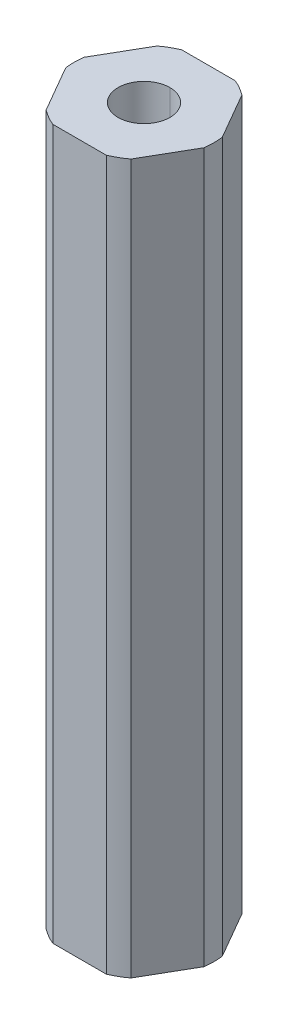
ISO-10303-21;
HEADER;
FILE_DESCRIPTION(('STEP AP214'),'2;1');
FILE_NAME('part.step','',(''),(''),'','','');
FILE_SCHEMA(('AUTOMOTIVE_DESIGN { 1 0 10303 214 1 1 1 1 }'));
ENDSEC;
DATA;
#1=APPLICATION_CONTEXT('core data for automotive mechanical design processes');
#2=APPLICATION_PROTOCOL_DEFINITION('international standard','automotive_design',2000,#1);
#3=PRODUCT_CONTEXT('',#1,'mechanical');
#4=PRODUCT('Part','Part','',(#3));
#5=PRODUCT_RELATED_PRODUCT_CATEGORY('part','',(#4));
#6=PRODUCT_DEFINITION_FORMATION('','',#4);
#7=PRODUCT_DEFINITION_CONTEXT('part definition',#1,'design');
#8=PRODUCT_DEFINITION('design','',#6,#7);
#9=PRODUCT_DEFINITION_SHAPE('','',#8);
#10=(LENGTH_UNIT() NAMED_UNIT(*) SI_UNIT(.MILLI.,.METRE.));
#11=(NAMED_UNIT(*) PLANE_ANGLE_UNIT() SI_UNIT($,.RADIAN.));
#12=(NAMED_UNIT(*) SI_UNIT($,.STERADIAN.) SOLID_ANGLE_UNIT());
#13=UNCERTAINTY_MEASURE_WITH_UNIT(LENGTH_MEASURE(1.E-05),#10,'distance_accuracy_value','');
#14=(GEOMETRIC_REPRESENTATION_CONTEXT(3) GLOBAL_UNCERTAINTY_ASSIGNED_CONTEXT((#13)) GLOBAL_UNIT_ASSIGNED_CONTEXT((#10,
#11,#12)) REPRESENTATION_CONTEXT('',''));
#15=CARTESIAN_POINT('',(0.,0.,0.));
#16=DIRECTION('',(0.,0.,1.));
#17=DIRECTION('',(1.,0.,0.));
#18=AXIS2_PLACEMENT_3D('',#15,#16,#17);
#19=CARTESIAN_POINT('',(5.49926131403118,-34.925,-3.175));
#20=DIRECTION('',(-0.866025403784439,0.,0.5));
#21=DIRECTION('',(0.,1.,0.));
#22=AXIS2_PLACEMENT_3D('',#19,#20,#21);
#23=PLANE('',#22);
#24=DIRECTION('',(0.5,0.,0.866025403784439));
#25=VECTOR('',#24,1.);
#26=CARTESIAN_POINT('',(5.49926131403118,34.925,-3.175));
#27=LINE('',#26,#25);
#28=CARTESIAN_POINT('',(4.18177080173137,34.925,-5.45696050579321));
#29=VERTEX_POINT('',#28);
#30=CARTESIAN_POINT('',(6.81675182633099,34.925,-0.893039494206796));
#31=VERTEX_POINT('',#30);
#32=EDGE_CURVE('E175',#29,#31,#27,.T.);
#33=ORIENTED_EDGE('',*,*,#32,.T.);
#34=DIRECTION('',(0.,1.,0.));
#35=VECTOR('',#34,1.);
#36=CARTESIAN_POINT('',(6.81675182633099,-34.925,-0.893039494206796));
#37=LINE('',#36,#35);
#38=CARTESIAN_POINT('',(6.81675182633099,-34.925,-0.893039494206796));
#39=VERTEX_POINT('',#38);
#40=EDGE_CURVE('E11',#39,#31,#37,.T.);
#41=ORIENTED_EDGE('',*,*,#40,.F.);
#42=DIRECTION('',(0.5,0.,0.866025403784439));
#43=VECTOR('',#42,1.);
#44=CARTESIAN_POINT('',(5.49926131403118,-34.925,-3.175));
#45=LINE('',#44,#43);
#46=CARTESIAN_POINT('',(4.18177080173137,-34.925,-5.45696050579321));
#47=VERTEX_POINT('',#46);
#48=EDGE_CURVE('E190',#47,#39,#45,.T.);
#49=ORIENTED_EDGE('',*,*,#48,.F.);
#50=DIRECTION('',(0.,1.,0.));
#51=VECTOR('',#50,1.);
#52=CARTESIAN_POINT('',(4.18177080173137,-34.925,-5.45696050579321));
#53=LINE('',#52,#51);
#54=EDGE_CURVE('E166',#47,#29,#53,.T.);
#55=ORIENTED_EDGE('',*,*,#54,.T.);
#56=EDGE_LOOP('',(#33,#41,#49,#55));
#57=FACE_BOUND('',#56,.T.);
#58=ADVANCED_FACE('F17',(#57),#23,.F.);
#59=CARTESIAN_POINT('',(0.,-34.925,0.));
#60=DIRECTION('',(0.,1.,0.));
#61=DIRECTION('',(0.,0.,1.));
#62=AXIS2_PLACEMENT_3D('',#59,#60,#61);
#63=CYLINDRICAL_SURFACE('',#62,6.875);
#64=CARTESIAN_POINT('',(0.,34.925,0.));
#65=DIRECTION('',(0.,-1.,0.));
#66=DIRECTION('',(0.,0.,-1.));
#67=AXIS2_PLACEMENT_3D('',#64,#65,#66);
#68=CIRCLE('',#67,6.875);
#69=CARTESIAN_POINT('',(6.81675182633099,34.925,0.893039494206792));
#70=VERTEX_POINT('',#69);
#71=EDGE_CURVE('E191',#31,#70,#68,.T.);
#72=ORIENTED_EDGE('',*,*,#71,.T.);
#73=DIRECTION('',(0.,1.,0.));
#74=VECTOR('',#73,1.);
#75=CARTESIAN_POINT('',(6.81675182633099,-34.925,0.893039494206792));
#76=LINE('',#75,#74);
#77=CARTESIAN_POINT('',(6.81675182633099,-34.925,0.893039494206792));
#78=VERTEX_POINT('',#77);
#79=EDGE_CURVE('E25',#78,#70,#76,.T.);
#80=ORIENTED_EDGE('',*,*,#79,.F.);
#81=CARTESIAN_POINT('',(0.,-34.925,0.));
#82=DIRECTION('',(0.,-1.,0.));
#83=DIRECTION('',(0.,0.,-1.));
#84=AXIS2_PLACEMENT_3D('',#81,#82,#83);
#85=CIRCLE('',#84,6.875);
#86=EDGE_CURVE('E256',#39,#78,#85,.T.);
#87=ORIENTED_EDGE('',*,*,#86,.F.);
#88=ORIENTED_EDGE('',*,*,#40,.T.);
#89=EDGE_LOOP('',(#72,#80,#87,#88));
#90=FACE_BOUND('',#89,.T.);
#91=ADVANCED_FACE('F335',(#90),#63,.T.);
#92=CARTESIAN_POINT('',(5.49926131403119,-34.925,3.175));
#93=DIRECTION('',(-0.866025403784439,0.,-0.5));
#94=DIRECTION('',(-0.5,0.,0.866025403784439));
#95=AXIS2_PLACEMENT_3D('',#92,#93,#94);
#96=PLANE('',#95);
#97=DIRECTION('',(-0.5,0.,0.866025403784439));
#98=VECTOR('',#97,1.);
#99=CARTESIAN_POINT('',(5.49926131403119,34.925,3.175));
#100=LINE('',#99,#98);
#101=CARTESIAN_POINT('',(4.18177080173138,34.925,5.45696050579321));
#102=VERTEX_POINT('',#101);
#103=EDGE_CURVE('E220',#70,#102,#100,.T.);
#104=ORIENTED_EDGE('',*,*,#103,.T.);
#105=DIRECTION('',(0.,1.,0.));
#106=VECTOR('',#105,1.);
#107=CARTESIAN_POINT('',(4.18177080173138,-34.925,5.45696050579321));
#108=LINE('',#107,#106);
#109=CARTESIAN_POINT('',(4.18177080173138,-34.925,5.45696050579321));
#110=VERTEX_POINT('',#109);
#111=EDGE_CURVE('E304',#110,#102,#108,.T.);
#112=ORIENTED_EDGE('',*,*,#111,.F.);
#113=DIRECTION('',(-0.5,0.,0.866025403784439));
#114=VECTOR('',#113,1.);
#115=CARTESIAN_POINT('',(5.49926131403119,-34.925,3.175));
#116=LINE('',#115,#114);
#117=EDGE_CURVE('E208',#78,#110,#116,.T.);
#118=ORIENTED_EDGE('',*,*,#117,.F.);
#119=ORIENTED_EDGE('',*,*,#79,.T.);
#120=EDGE_LOOP('',(#104,#112,#118,#119));
#121=FACE_BOUND('',#120,.T.);
#122=ADVANCED_FACE('F321',(#121),#96,.F.);
#123=CARTESIAN_POINT('',(0.,-34.925,0.));
#124=DIRECTION('',(0.,1.,0.));
#125=DIRECTION('',(0.,0.,1.));
#126=AXIS2_PLACEMENT_3D('',#123,#124,#125);
#127=CYLINDRICAL_SURFACE('',#126,6.875);
#128=CARTESIAN_POINT('',(0.,34.925,0.));
#129=DIRECTION('',(0.,-1.,0.));
#130=DIRECTION('',(0.,0.,-1.));
#131=AXIS2_PLACEMENT_3D('',#128,#129,#130);
#132=CIRCLE('',#131,6.875);
#133=CARTESIAN_POINT('',(2.63498102459961,34.925,6.35));
#134=VERTEX_POINT('',#133);
#135=EDGE_CURVE('E228',#102,#134,#132,.T.);
#136=ORIENTED_EDGE('',*,*,#135,.T.);
#137=DIRECTION('',(0.,1.,0.));
#138=VECTOR('',#137,1.);
#139=CARTESIAN_POINT('',(2.63498102459961,-34.925,6.35));
#140=LINE('',#139,#138);
#141=CARTESIAN_POINT('',(2.63498102459961,-34.925,6.35));
#142=VERTEX_POINT('',#141);
#143=EDGE_CURVE('E246',#142,#134,#140,.T.);
#144=ORIENTED_EDGE('',*,*,#143,.F.);
#145=CARTESIAN_POINT('',(0.,-34.925,0.));
#146=DIRECTION('',(0.,-1.,0.));
#147=DIRECTION('',(0.,0.,-1.));
#148=AXIS2_PLACEMENT_3D('',#145,#146,#147);
#149=CIRCLE('',#148,6.875);
#150=EDGE_CURVE('E203',#110,#142,#149,.T.);
#151=ORIENTED_EDGE('',*,*,#150,.F.);
#152=ORIENTED_EDGE('',*,*,#111,.T.);
#153=EDGE_LOOP('',(#136,#144,#151,#152));
#154=FACE_BOUND('',#153,.T.);
#155=ADVANCED_FACE('F315',(#154),#127,.T.);
#156=CARTESIAN_POINT('',(0.,-34.925,6.35));
#157=DIRECTION('',(0.,0.,-1.));
#158=DIRECTION('',(0.,-1.,0.));
#159=AXIS2_PLACEMENT_3D('',#156,#157,#158);
#160=PLANE('',#159);
#161=DIRECTION('',(-1.,0.,0.));
#162=VECTOR('',#161,1.);
#163=CARTESIAN_POINT('',(0.,34.925,6.35));
#164=LINE('',#163,#162);
#165=CARTESIAN_POINT('',(-2.63498102459961,34.925,6.35));
#166=VERTEX_POINT('',#165);
#167=EDGE_CURVE('E232',#134,#166,#164,.T.);
#168=ORIENTED_EDGE('',*,*,#167,.T.);
#169=DIRECTION('',(0.,1.,0.));
#170=VECTOR('',#169,1.);
#171=CARTESIAN_POINT('',(-2.63498102459961,-34.925,6.35));
#172=LINE('',#171,#170);
#173=CARTESIAN_POINT('',(-2.63498102459961,-34.925,6.35));
#174=VERTEX_POINT('',#173);
#175=EDGE_CURVE('E243',#174,#166,#172,.T.);
#176=ORIENTED_EDGE('',*,*,#175,.F.);
#177=DIRECTION('',(-1.,0.,0.));
#178=VECTOR('',#177,1.);
#179=CARTESIAN_POINT('',(0.,-34.925,6.35));
#180=LINE('',#179,#178);
#181=EDGE_CURVE('E207',#142,#174,#180,.T.);
#182=ORIENTED_EDGE('',*,*,#181,.F.);
#183=ORIENTED_EDGE('',*,*,#143,.T.);
#184=EDGE_LOOP('',(#168,#176,#182,#183));
#185=FACE_BOUND('',#184,.T.);
#186=ADVANCED_FACE('F329',(#185),#160,.F.);
#187=CARTESIAN_POINT('',(0.,-34.925,0.));
#188=DIRECTION('',(0.,1.,0.));
#189=DIRECTION('',(0.,0.,1.));
#190=AXIS2_PLACEMENT_3D('',#187,#188,#189);
#191=CYLINDRICAL_SURFACE('',#190,6.875);
#192=CARTESIAN_POINT('',(0.,34.925,0.));
#193=DIRECTION('',(0.,-1.,0.));
#194=DIRECTION('',(0.,0.,-1.));
#195=AXIS2_PLACEMENT_3D('',#192,#193,#194);
#196=CIRCLE('',#195,6.875);
#197=CARTESIAN_POINT('',(-4.18177080173138,34.925,5.45696050579322));
#198=VERTEX_POINT('',#197);
#199=EDGE_CURVE('E233',#166,#198,#196,.T.);
#200=ORIENTED_EDGE('',*,*,#199,.T.);
#201=DIRECTION('',(0.,1.,0.));
#202=VECTOR('',#201,1.);
#203=CARTESIAN_POINT('',(-4.18177080173138,-34.925,5.45696050579322));
#204=LINE('',#203,#202);
#205=CARTESIAN_POINT('',(-4.18177080173138,-34.925,5.45696050579322));
#206=VERTEX_POINT('',#205);
#207=EDGE_CURVE('E224',#206,#198,#204,.T.);
#208=ORIENTED_EDGE('',*,*,#207,.F.);
#209=CARTESIAN_POINT('',(0.,-34.925,0.));
#210=DIRECTION('',(0.,-1.,0.));
#211=DIRECTION('',(0.,0.,-1.));
#212=AXIS2_PLACEMENT_3D('',#209,#210,#211);
#213=CIRCLE('',#212,6.875);
#214=EDGE_CURVE('E266',#174,#206,#213,.T.);
#215=ORIENTED_EDGE('',*,*,#214,.F.);
#216=ORIENTED_EDGE('',*,*,#175,.T.);
#217=EDGE_LOOP('',(#200,#208,#215,#216));
#218=FACE_BOUND('',#217,.T.);
#219=ADVANCED_FACE('F356',(#218),#191,.T.);
#220=CARTESIAN_POINT('',(-5.49926131403118,-34.925,3.175));
#221=DIRECTION('',(0.866025403784439,0.,-0.5));
#222=DIRECTION('',(0.,-1.,0.));
#223=AXIS2_PLACEMENT_3D('',#220,#221,#222);
#224=PLANE('',#223);
#225=DIRECTION('',(-0.5,0.,-0.866025403784439));
#226=VECTOR('',#225,1.);
#227=CARTESIAN_POINT('',(-5.49926131403118,34.925,3.175));
#228=LINE('',#227,#226);
#229=CARTESIAN_POINT('',(-6.81675182633099,34.925,0.893039494206796));
#230=VERTEX_POINT('',#229);
#231=EDGE_CURVE('E201',#198,#230,#228,.T.);
#232=ORIENTED_EDGE('',*,*,#231,.T.);
#233=DIRECTION('',(0.,1.,0.));
#234=VECTOR('',#233,1.);
#235=CARTESIAN_POINT('',(-6.81675182633099,-34.925,0.893039494206796));
#236=LINE('',#235,#234);
#237=CARTESIAN_POINT('',(-6.81675182633099,-34.925,0.893039494206796));
#238=VERTEX_POINT('',#237);
#239=EDGE_CURVE('E221',#238,#230,#236,.T.);
#240=ORIENTED_EDGE('',*,*,#239,.F.);
#241=DIRECTION('',(-0.5,0.,-0.866025403784439));
#242=VECTOR('',#241,1.);
#243=CARTESIAN_POINT('',(-5.49926131403118,-34.925,3.175));
#244=LINE('',#243,#242);
#245=EDGE_CURVE('E270',#206,#238,#244,.T.);
#246=ORIENTED_EDGE('',*,*,#245,.F.);
#247=ORIENTED_EDGE('',*,*,#207,.T.);
#248=EDGE_LOOP('',(#232,#240,#246,#247));
#249=FACE_BOUND('',#248,.T.);
#250=ADVANCED_FACE('F354',(#249),#224,.F.);
#251=CARTESIAN_POINT('',(0.,-34.925,0.));
#252=DIRECTION('',(0.,1.,0.));
#253=DIRECTION('',(0.,0.,1.));
#254=AXIS2_PLACEMENT_3D('',#251,#252,#253);
#255=CYLINDRICAL_SURFACE('',#254,6.875);
#256=CARTESIAN_POINT('',(0.,34.925,0.));
#257=DIRECTION('',(0.,-1.,0.));
#258=DIRECTION('',(0.,0.,-1.));
#259=AXIS2_PLACEMENT_3D('',#256,#257,#258);
#260=CIRCLE('',#259,6.875);
#261=CARTESIAN_POINT('',(-6.81675182633099,34.925,-0.893039494206792));
#262=VERTEX_POINT('',#261);
#263=EDGE_CURVE('E197',#230,#262,#260,.T.);
#264=ORIENTED_EDGE('',*,*,#263,.T.);
#265=DIRECTION('',(0.,1.,0.));
#266=VECTOR('',#265,1.);
#267=CARTESIAN_POINT('',(-6.81675182633099,-34.925,-0.893039494206792));
#268=LINE('',#267,#266);
#269=CARTESIAN_POINT('',(-6.81675182633099,-34.925,-0.893039494206792));
#270=VERTEX_POINT('',#269);
#271=EDGE_CURVE('E225',#270,#262,#268,.T.);
#272=ORIENTED_EDGE('',*,*,#271,.F.);
#273=CARTESIAN_POINT('',(0.,-34.925,0.));
#274=DIRECTION('',(0.,-1.,0.));
#275=DIRECTION('',(0.,0.,-1.));
#276=AXIS2_PLACEMENT_3D('',#273,#274,#275);
#277=CIRCLE('',#276,6.875);
#278=EDGE_CURVE('E274',#238,#270,#277,.T.);
#279=ORIENTED_EDGE('',*,*,#278,.F.);
#280=ORIENTED_EDGE('',*,*,#239,.T.);
#281=EDGE_LOOP('',(#264,#272,#279,#280));
#282=FACE_BOUND('',#281,.T.);
#283=ADVANCED_FACE('F350',(#282),#255,.T.);
#284=CARTESIAN_POINT('',(-5.49926131403119,-34.925,-3.175));
#285=DIRECTION('',(0.866025403784439,0.,0.5));
#286=DIRECTION('',(0.,-1.,0.));
#287=AXIS2_PLACEMENT_3D('',#284,#285,#286);
#288=PLANE('',#287);
#289=DIRECTION('',(0.5,0.,-0.866025403784439));
#290=VECTOR('',#289,1.);
#291=CARTESIAN_POINT('',(-5.49926131403119,34.925,-3.175));
#292=LINE('',#291,#290);
#293=CARTESIAN_POINT('',(-4.18177080173138,34.925,-5.45696050579321));
#294=VERTEX_POINT('',#293);
#295=EDGE_CURVE('E202',#262,#294,#292,.T.);
#296=ORIENTED_EDGE('',*,*,#295,.T.);
#297=DIRECTION('',(0.,1.,0.));
#298=VECTOR('',#297,1.);
#299=CARTESIAN_POINT('',(-4.18177080173138,-34.925,-5.45696050579321));
#300=LINE('',#299,#298);
#301=CARTESIAN_POINT('',(-4.18177080173138,-34.925,-5.45696050579321));
#302=VERTEX_POINT('',#301);
#303=EDGE_CURVE('E299',#302,#294,#300,.T.);
#304=ORIENTED_EDGE('',*,*,#303,.F.);
#305=DIRECTION('',(0.5,0.,-0.866025403784439));
#306=VECTOR('',#305,1.);
#307=CARTESIAN_POINT('',(-5.49926131403119,-34.925,-3.175));
#308=LINE('',#307,#306);
#309=EDGE_CURVE('E278',#270,#302,#308,.T.);
#310=ORIENTED_EDGE('',*,*,#309,.F.);
#311=ORIENTED_EDGE('',*,*,#271,.T.);
#312=EDGE_LOOP('',(#296,#304,#310,#311));
#313=FACE_BOUND('',#312,.T.);
#314=ADVANCED_FACE('F347',(#313),#288,.F.);
#315=CARTESIAN_POINT('',(0.,-34.925,0.));
#316=DIRECTION('',(0.,1.,0.));
#317=DIRECTION('',(0.,0.,1.));
#318=AXIS2_PLACEMENT_3D('',#315,#316,#317);
#319=CYLINDRICAL_SURFACE('',#318,6.875);
#320=CARTESIAN_POINT('',(0.,34.925,0.));
#321=DIRECTION('',(0.,-1.,0.));
#322=DIRECTION('',(0.,0.,-1.));
#323=AXIS2_PLACEMENT_3D('',#320,#321,#322);
#324=CIRCLE('',#323,6.875);
#325=CARTESIAN_POINT('',(-2.63498102459961,34.925,-6.35));
#326=VERTEX_POINT('',#325);
#327=EDGE_CURVE('E216',#294,#326,#324,.T.);
#328=ORIENTED_EDGE('',*,*,#327,.T.);
#329=DIRECTION('',(0.,1.,0.));
#330=VECTOR('',#329,1.);
#331=CARTESIAN_POINT('',(-2.63498102459961,-34.925,-6.35));
#332=LINE('',#331,#330);
#333=CARTESIAN_POINT('',(-2.63498102459961,-34.925,-6.35));
#334=VERTEX_POINT('',#333);
#335=EDGE_CURVE('E49',#334,#326,#332,.T.);
#336=ORIENTED_EDGE('',*,*,#335,.F.);
#337=CARTESIAN_POINT('',(0.,-34.925,0.));
#338=DIRECTION('',(0.,-1.,0.));
#339=DIRECTION('',(0.,0.,-1.));
#340=AXIS2_PLACEMENT_3D('',#337,#338,#339);
#341=CIRCLE('',#340,6.875);
#342=EDGE_CURVE('E282',#302,#334,#341,.T.);
#343=ORIENTED_EDGE('',*,*,#342,.F.);
#344=ORIENTED_EDGE('',*,*,#303,.T.);
#345=EDGE_LOOP('',(#328,#336,#343,#344));
#346=FACE_BOUND('',#345,.T.);
#347=ADVANCED_FACE('F344',(#346),#319,.T.);
#348=CARTESIAN_POINT('',(0.,-34.925,-6.35));
#349=DIRECTION('',(0.,0.,1.));
#350=DIRECTION('',(1.,0.,0.));
#351=AXIS2_PLACEMENT_3D('',#348,#349,#350);
#352=PLANE('',#351);
#353=DIRECTION('',(1.,0.,0.));
#354=VECTOR('',#353,1.);
#355=CARTESIAN_POINT('',(0.,34.925,-6.35));
#356=LINE('',#355,#354);
#357=CARTESIAN_POINT('',(2.63498102459961,34.925,-6.35));
#358=VERTEX_POINT('',#357);
#359=EDGE_CURVE('E195',#326,#358,#356,.T.);
#360=ORIENTED_EDGE('',*,*,#359,.T.);
#361=DIRECTION('',(0.,1.,0.));
#362=VECTOR('',#361,1.);
#363=CARTESIAN_POINT('',(2.63498102459961,-34.925,-6.35));
#364=LINE('',#363,#362);
#365=CARTESIAN_POINT('',(2.63498102459961,-34.925,-6.35));
#366=VERTEX_POINT('',#365);
#367=EDGE_CURVE('E38',#366,#358,#364,.T.);
#368=ORIENTED_EDGE('',*,*,#367,.F.);
#369=DIRECTION('',(1.,0.,0.));
#370=VECTOR('',#369,1.);
#371=CARTESIAN_POINT('',(0.,-34.925,-6.35));
#372=LINE('',#371,#370);
#373=EDGE_CURVE('E286',#334,#366,#372,.T.);
#374=ORIENTED_EDGE('',*,*,#373,.F.);
#375=ORIENTED_EDGE('',*,*,#335,.T.);
#376=EDGE_LOOP('',(#360,#368,#374,#375));
#377=FACE_BOUND('',#376,.T.);
#378=ADVANCED_FACE('F343',(#377),#352,.F.);
#379=CARTESIAN_POINT('',(0.,-34.925,0.));
#380=DIRECTION('',(0.,1.,0.));
#381=DIRECTION('',(0.,0.,1.));
#382=AXIS2_PLACEMENT_3D('',#379,#380,#381);
#383=CYLINDRICAL_SURFACE('',#382,2.5527);
#384=DIRECTION('',(0.,1.,0.));
#385=VECTOR('',#384,1.);
#386=CARTESIAN_POINT('',(0.,-34.925,-2.5527));
#387=LINE('',#386,#385);
#388=CARTESIAN_POINT('',(0.,-34.925,-2.5527));
#389=VERTEX_POINT('',#388);
#390=CARTESIAN_POINT('',(0.,34.925,-2.5527));
#391=VERTEX_POINT('',#390);
#392=EDGE_CURVE('E161',#389,#391,#387,.T.);
#393=ORIENTED_EDGE('',*,*,#392,.F.);
#394=CARTESIAN_POINT('',(0.,-34.925,0.));
#395=DIRECTION('',(0.,-1.,0.));
#396=DIRECTION('',(0.,0.,-1.));
#397=AXIS2_PLACEMENT_3D('',#394,#395,#396);
#398=CIRCLE('',#397,2.5527);
#399=CARTESIAN_POINT('',(0.,-34.925,2.5527));
#400=VERTEX_POINT('',#399);
#401=EDGE_CURVE('E155',#389,#400,#398,.T.);
#402=ORIENTED_EDGE('',*,*,#401,.T.);
#403=DIRECTION('',(0.,1.,0.));
#404=VECTOR('',#403,1.);
#405=CARTESIAN_POINT('',(0.,-34.925,2.5527));
#406=LINE('',#405,#404);
#407=CARTESIAN_POINT('',(0.,34.925,2.5527));
#408=VERTEX_POINT('',#407);
#409=EDGE_CURVE('E158',#400,#408,#406,.T.);
#410=ORIENTED_EDGE('',*,*,#409,.T.);
#411=CARTESIAN_POINT('',(0.,34.925,0.));
#412=DIRECTION('',(0.,-1.,0.));
#413=DIRECTION('',(0.,0.,-1.));
#414=AXIS2_PLACEMENT_3D('',#411,#412,#413);
#415=CIRCLE('',#414,2.5527);
#416=EDGE_CURVE('E187',#391,#408,#415,.T.);
#417=ORIENTED_EDGE('',*,*,#416,.F.);
#418=EDGE_LOOP('',(#393,#402,#410,#417));
#419=FACE_BOUND('',#418,.T.);
#420=ADVANCED_FACE('F157',(#419),#383,.F.);
#421=CARTESIAN_POINT('',(0.,-34.925,0.));
#422=DIRECTION('',(0.,1.,0.));
#423=DIRECTION('',(0.,0.,1.));
#424=AXIS2_PLACEMENT_3D('',#421,#422,#423);
#425=CYLINDRICAL_SURFACE('',#424,6.875);
#426=CARTESIAN_POINT('',(0.,34.925,0.));
#427=DIRECTION('',(0.,-1.,0.));
#428=DIRECTION('',(0.,0.,-1.));
#429=AXIS2_PLACEMENT_3D('',#426,#427,#428);
#430=CIRCLE('',#429,6.875);
#431=EDGE_CURVE('E192',#358,#29,#430,.T.);
#432=ORIENTED_EDGE('',*,*,#431,.T.);
#433=ORIENTED_EDGE('',*,*,#54,.F.);
#434=CARTESIAN_POINT('',(0.,-34.925,0.));
#435=DIRECTION('',(0.,-1.,0.));
#436=DIRECTION('',(0.,0.,-1.));
#437=AXIS2_PLACEMENT_3D('',#434,#435,#436);
#438=CIRCLE('',#437,6.875);
#439=EDGE_CURVE('E167',#366,#47,#438,.T.);
#440=ORIENTED_EDGE('',*,*,#439,.F.);
#441=ORIENTED_EDGE('',*,*,#367,.T.);
#442=EDGE_LOOP('',(#432,#433,#440,#441));
#443=FACE_BOUND('',#442,.T.);
#444=ADVANCED_FACE('F339',(#443),#425,.T.);
#445=CARTESIAN_POINT('',(0.,-34.925,0.));
#446=DIRECTION('',(0.,-1.,0.));
#447=DIRECTION('',(0.,0.,-1.));
#448=AXIS2_PLACEMENT_3D('',#445,#446,#447);
#449=PLANE('',#448);
#450=CARTESIAN_POINT('',(0.,-34.925,0.));
#451=DIRECTION('',(0.,-1.,0.));
#452=DIRECTION('',(0.,0.,-1.));
#453=AXIS2_PLACEMENT_3D('',#450,#451,#452);
#454=CIRCLE('',#453,2.5527);
#455=EDGE_CURVE('E171',#400,#389,#454,.T.);
#456=ORIENTED_EDGE('',*,*,#455,.F.);
#457=ORIENTED_EDGE('',*,*,#401,.F.);
#458=EDGE_LOOP('',(#456,#457));
#459=FACE_BOUND('',#458,.T.);
#460=ORIENTED_EDGE('',*,*,#48,.T.);
#461=ORIENTED_EDGE('',*,*,#86,.T.);
#462=ORIENTED_EDGE('',*,*,#117,.T.);
#463=ORIENTED_EDGE('',*,*,#150,.T.);
#464=ORIENTED_EDGE('',*,*,#181,.T.);
#465=ORIENTED_EDGE('',*,*,#214,.T.);
#466=ORIENTED_EDGE('',*,*,#245,.T.);
#467=ORIENTED_EDGE('',*,*,#278,.T.);
#468=ORIENTED_EDGE('',*,*,#309,.T.);
#469=ORIENTED_EDGE('',*,*,#342,.T.);
#470=ORIENTED_EDGE('',*,*,#373,.T.);
#471=ORIENTED_EDGE('',*,*,#439,.T.);
#472=EDGE_LOOP('',(#460,#461,#462,#463,#464,#465,#466,#467,#468,#469,#470,#471));
#473=FACE_BOUND('',#472,.T.);
#474=ADVANCED_FACE('F177',(#459,#473),#449,.T.);
#475=CARTESIAN_POINT('',(0.,34.925,0.));
#476=DIRECTION('',(0.,-1.,0.));
#477=DIRECTION('',(0.,0.,-1.));
#478=AXIS2_PLACEMENT_3D('',#475,#476,#477);
#479=PLANE('',#478);
#480=CARTESIAN_POINT('',(0.,34.925,0.));
#481=DIRECTION('',(0.,-1.,0.));
#482=DIRECTION('',(0.,0.,-1.));
#483=AXIS2_PLACEMENT_3D('',#480,#481,#482);
#484=CIRCLE('',#483,2.5527);
#485=EDGE_CURVE('E173',#408,#391,#484,.T.);
#486=ORIENTED_EDGE('',*,*,#485,.T.);
#487=ORIENTED_EDGE('',*,*,#416,.T.);
#488=EDGE_LOOP('',(#486,#487));
#489=FACE_BOUND('',#488,.T.);
#490=ORIENTED_EDGE('',*,*,#32,.F.);
#491=ORIENTED_EDGE('',*,*,#431,.F.);
#492=ORIENTED_EDGE('',*,*,#359,.F.);
#493=ORIENTED_EDGE('',*,*,#327,.F.);
#494=ORIENTED_EDGE('',*,*,#295,.F.);
#495=ORIENTED_EDGE('',*,*,#263,.F.);
#496=ORIENTED_EDGE('',*,*,#231,.F.);
#497=ORIENTED_EDGE('',*,*,#199,.F.);
#498=ORIENTED_EDGE('',*,*,#167,.F.);
#499=ORIENTED_EDGE('',*,*,#135,.F.);
#500=ORIENTED_EDGE('',*,*,#103,.F.);
#501=ORIENTED_EDGE('',*,*,#71,.F.);
#502=EDGE_LOOP('',(#490,#491,#492,#493,#494,#495,#496,#497,#498,#499,#500,#501));
#503=FACE_BOUND('',#502,.T.);
#504=ADVANCED_FACE('F325',(#489,#503),#479,.F.);
#505=CARTESIAN_POINT('',(0.,-34.925,0.));
#506=DIRECTION('',(0.,1.,0.));
#507=DIRECTION('',(0.,0.,1.));
#508=AXIS2_PLACEMENT_3D('',#505,#506,#507);
#509=CYLINDRICAL_SURFACE('',#508,2.5527);
#510=ORIENTED_EDGE('',*,*,#455,.T.);
#511=ORIENTED_EDGE('',*,*,#392,.T.);
#512=ORIENTED_EDGE('',*,*,#485,.F.);
#513=ORIENTED_EDGE('',*,*,#409,.F.);
#514=EDGE_LOOP('',(#510,#511,#512,#513));
#515=FACE_BOUND('',#514,.T.);
#516=ADVANCED_FACE('F170',(#515),#509,.F.);
#517=CLOSED_SHELL('',(#58,#91,#122,#155,#186,#219,#250,#283,#314,#347,#378,#420,#444,#474,#504,#516));
#518=MANIFOLD_SOLID_BREP('B1',#517);
#519=ADVANCED_BREP_SHAPE_REPRESENTATION('',(#18,#518),#14);
#520=SHAPE_DEFINITION_REPRESENTATION(#9,#519);
ENDSEC;
END-ISO-10303-21;
